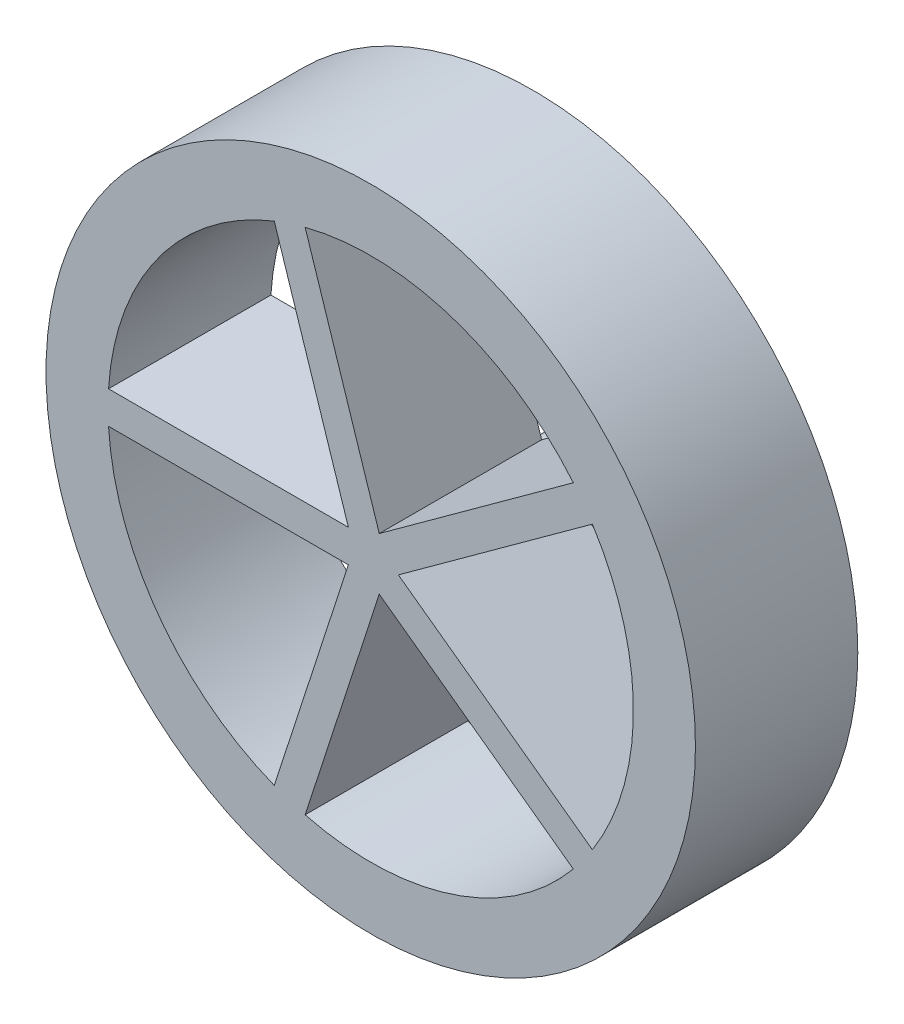
ISO-10303-21;
HEADER;
FILE_DESCRIPTION(('STEP AP214'),'2;1');
FILE_NAME('part.step','',(''),(''),'','','');
FILE_SCHEMA(('AUTOMOTIVE_DESIGN { 1 0 10303 214 1 1 1 1 }'));
ENDSEC;
DATA;
#1=APPLICATION_CONTEXT('core data for automotive mechanical design processes');
#2=APPLICATION_PROTOCOL_DEFINITION('international standard','automotive_design',2000,#1);
#3=PRODUCT_CONTEXT('',#1,'mechanical');
#4=PRODUCT('Part','Part','',(#3));
#5=PRODUCT_RELATED_PRODUCT_CATEGORY('part','',(#4));
#6=PRODUCT_DEFINITION_FORMATION('','',#4);
#7=PRODUCT_DEFINITION_CONTEXT('part definition',#1,'design');
#8=PRODUCT_DEFINITION('design','',#6,#7);
#9=PRODUCT_DEFINITION_SHAPE('','',#8);
#10=(LENGTH_UNIT() NAMED_UNIT(*) SI_UNIT(.MILLI.,.METRE.));
#11=(NAMED_UNIT(*) PLANE_ANGLE_UNIT() SI_UNIT($,.RADIAN.));
#12=(NAMED_UNIT(*) SI_UNIT($,.STERADIAN.) SOLID_ANGLE_UNIT());
#13=UNCERTAINTY_MEASURE_WITH_UNIT(LENGTH_MEASURE(1.E-05),#10,'distance_accuracy_value','');
#14=(GEOMETRIC_REPRESENTATION_CONTEXT(3) GLOBAL_UNCERTAINTY_ASSIGNED_CONTEXT((#13)) GLOBAL_UNIT_ASSIGNED_CONTEXT((#10,
#11,#12)) REPRESENTATION_CONTEXT('',''));
#15=CARTESIAN_POINT('',(0.,0.,0.));
#16=DIRECTION('',(0.,0.,1.));
#17=DIRECTION('',(1.,0.,0.));
#18=AXIS2_PLACEMENT_3D('',#15,#16,#17);
#19=CARTESIAN_POINT('',(0.,0.,-40.));
#20=DIRECTION('',(0.,0.,-1.));
#21=DIRECTION('',(-1.,0.,0.));
#22=AXIS2_PLACEMENT_3D('',#19,#20,#21);
#23=PLANE('',#22);
#24=CARTESIAN_POINT('',(0.,0.,-40.));
#25=DIRECTION('',(0.,0.,1.));
#26=DIRECTION('',(1.,0.,0.));
#27=AXIS2_PLACEMENT_3D('',#24,#25,#26);
#28=CIRCLE('',#27,5.);
#29=CARTESIAN_POINT('',(5.,0.,-40.));
#30=VERTEX_POINT('',#29);
#31=EDGE_CURVE('E20',#30,#30,#28,.T.);
#32=ORIENTED_EDGE('',*,*,#31,.F.);
#33=EDGE_LOOP('',(#32));
#34=FACE_BOUND('',#33,.T.);
#35=ADVANCED_FACE('F17',(#34),#23,.T.);
#36=CARTESIAN_POINT('',(0.,0.,-40.));
#37=DIRECTION('',(0.,0.,1.));
#38=DIRECTION('',(1.,0.,0.));
#39=AXIS2_PLACEMENT_3D('',#36,#37,#38);
#40=CYLINDRICAL_SURFACE('',#39,5.);
#41=CARTESIAN_POINT('',(0.,0.,-25.));
#42=DIRECTION('',(0.,0.,1.));
#43=DIRECTION('',(1.,0.,0.));
#44=AXIS2_PLACEMENT_3D('',#41,#42,#43);
#45=CIRCLE('',#44,5.);
#46=CARTESIAN_POINT('',(5.,0.,-25.));
#47=VERTEX_POINT('',#46);
#48=EDGE_CURVE('E148',#47,#47,#45,.T.);
#49=ORIENTED_EDGE('',*,*,#48,.F.);
#50=EDGE_LOOP('',(#49));
#51=FACE_BOUND('',#50,.T.);
#52=ORIENTED_EDGE('',*,*,#31,.T.);
#53=EDGE_LOOP('',(#52));
#54=FACE_BOUND('',#53,.T.);
#55=ADVANCED_FACE('F353',(#51,#54),#40,.T.);
#56=CARTESIAN_POINT('',(3.33066907387547E-13,0.,-25.));
#57=DIRECTION('',(0.,0.,1.));
#58=DIRECTION('',(1.,0.,0.));
#59=AXIS2_PLACEMENT_3D('',#56,#57,#58);
#60=CYLINDRICAL_SURFACE('',#59,80.9016994374944);
#61=CARTESIAN_POINT('',(3.33066907387547E-13,0.,-25.));
#62=DIRECTION('',(0.,0.,1.));
#63=DIRECTION('',(1.,0.,0.));
#64=AXIS2_PLACEMENT_3D('',#61,#62,#63);
#65=CIRCLE('',#64,80.9016994374944);
#66=CARTESIAN_POINT('',(68.2646563873199,-43.4168361375617,-25.));
#67=VERTEX_POINT('',#66);
#68=CARTESIAN_POINT('',(68.2646563873198,43.4168361375617,-25.));
#69=VERTEX_POINT('',#68);
#70=EDGE_CURVE('E163',#67,#69,#65,.T.);
#71=ORIENTED_EDGE('',*,*,#70,.F.);
#72=DIRECTION('',(0.,0.,1.));
#73=VECTOR('',#72,1.);
#74=CARTESIAN_POINT('',(68.2646563873199,-43.4168361375618,-25.));
#75=LINE('',#74,#73);
#76=CARTESIAN_POINT('',(68.2646563873199,-43.4168361375617,25.));
#77=VERTEX_POINT('',#76);
#78=EDGE_CURVE('E194',#77,#67,#75,.F.);
#79=ORIENTED_EDGE('',*,*,#78,.F.);
#80=CARTESIAN_POINT('',(3.33066907387547E-13,0.,25.));
#81=DIRECTION('',(0.,0.,1.));
#82=DIRECTION('',(1.,0.,0.));
#83=AXIS2_PLACEMENT_3D('',#80,#81,#82);
#84=CIRCLE('',#83,80.9016994374944);
#85=CARTESIAN_POINT('',(68.2646563873198,43.4168361375617,25.));
#86=VERTEX_POINT('',#85);
#87=EDGE_CURVE('E171',#77,#86,#84,.T.);
#88=ORIENTED_EDGE('',*,*,#87,.T.);
#89=DIRECTION('',(0.,0.,1.));
#90=VECTOR('',#89,1.);
#91=CARTESIAN_POINT('',(68.2646563873199,43.4168361375618,-25.));
#92=LINE('',#91,#90);
#93=EDGE_CURVE('E191',#69,#86,#92,.T.);
#94=ORIENTED_EDGE('',*,*,#93,.F.);
#95=EDGE_LOOP('',(#71,#79,#88,#94));
#96=FACE_BOUND('',#95,.T.);
#97=ADVANCED_FACE('F351',(#96),#60,.F.);
#98=CARTESIAN_POINT('',(49.0430471916489,29.4515196002079,-25.));
#99=DIRECTION('',(0.587785252292474,-0.809016994374947,0.));
#100=DIRECTION('',(0.809016994374947,0.587785252292474,0.));
#101=AXIS2_PLACEMENT_3D('',#98,#99,#100);
#102=PLANE('',#101);
#103=DIRECTION('',(-0.809016994374948,-0.587785252292473,0.));
#104=VECTOR('',#103,1.);
#105=CARTESIAN_POINT('',(68.2646563873199,43.4168361375617,-25.));
#106=LINE('',#105,#104);
#107=CARTESIAN_POINT('',(8.50650808352037,0.,-25.));
#108=VERTEX_POINT('',#107);
#109=EDGE_CURVE('E161',#69,#108,#106,.T.);
#110=ORIENTED_EDGE('',*,*,#109,.F.);
#111=ORIENTED_EDGE('',*,*,#93,.T.);
#112=DIRECTION('',(-0.809016994374947,-0.587785252292473,0.));
#113=VECTOR('',#112,1.);
#114=CARTESIAN_POINT('',(68.2646563873199,43.4168361375618,25.));
#115=LINE('',#114,#113);
#116=CARTESIAN_POINT('',(8.50650808352037,0.,25.));
#117=VERTEX_POINT('',#116);
#118=EDGE_CURVE('E174',#86,#117,#115,.T.);
#119=ORIENTED_EDGE('',*,*,#118,.T.);
#120=DIRECTION('',(0.,0.,1.));
#121=VECTOR('',#120,1.);
#122=CARTESIAN_POINT('',(8.50650808352037,0.,-25.));
#123=LINE('',#122,#121);
#124=EDGE_CURVE('E197',#108,#117,#123,.T.);
#125=ORIENTED_EDGE('',*,*,#124,.F.);
#126=EDGE_LOOP('',(#110,#111,#119,#125));
#127=FACE_BOUND('',#126,.T.);
#128=ADVANCED_FACE('F347',(#127),#102,.T.);
#129=CARTESIAN_POINT('',(12.1988394185127,-2.68263574235874,-25.));
#130=DIRECTION('',(0.587785252292473,0.809016994374948,0.));
#131=DIRECTION('',(-0.809016994374948,0.587785252292473,0.));
#132=AXIS2_PLACEMENT_3D('',#129,#130,#131);
#133=PLANE('',#132);
#134=DIRECTION('',(0.809016994374948,-0.587785252292472,0.));
#135=VECTOR('',#134,1.);
#136=CARTESIAN_POINT('',(8.50650808352037,0.,-25.));
#137=LINE('',#136,#135);
#138=EDGE_CURVE('E167',#108,#67,#137,.T.);
#139=ORIENTED_EDGE('',*,*,#138,.F.);
#140=ORIENTED_EDGE('',*,*,#124,.T.);
#141=DIRECTION('',(0.809016994374948,-0.587785252292472,0.));
#142=VECTOR('',#141,1.);
#143=CARTESIAN_POINT('',(8.50650808352037,0.,25.));
#144=LINE('',#143,#142);
#145=EDGE_CURVE('E178',#117,#77,#144,.T.);
#146=ORIENTED_EDGE('',*,*,#145,.T.);
#147=ORIENTED_EDGE('',*,*,#78,.T.);
#148=EDGE_LOOP('',(#139,#140,#146,#147));
#149=FACE_BOUND('',#148,.T.);
#150=ADVANCED_FACE('F349',(#149),#133,.T.);
#151=CARTESIAN_POINT('',(-1.52655665885959E-13,0.,-25.));
#152=DIRECTION('',(0.,0.,1.));
#153=DIRECTION('',(1.,0.,0.));
#154=AXIS2_PLACEMENT_3D('',#151,#152,#153);
#155=CYLINDRICAL_SURFACE('',#154,80.9016994374946);
#156=DIRECTION('',(0.,0.,1.));
#157=VECTOR('',#156,1.);
#158=CARTESIAN_POINT('',(-29.7074911496504,-75.2499165545596,-25.));
#159=LINE('',#158,#157);
#160=CARTESIAN_POINT('',(-29.7074911496504,-75.2499165545595,-25.));
#161=VERTEX_POINT('',#160);
#162=CARTESIAN_POINT('',(-29.7074911496503,-75.2499165545595,25.));
#163=VERTEX_POINT('',#162);
#164=EDGE_CURVE('E200',#161,#163,#159,.T.);
#165=ORIENTED_EDGE('',*,*,#164,.F.);
#166=CARTESIAN_POINT('',(-1.52655665885959E-13,0.,-25.));
#167=DIRECTION('',(0.,0.,1.));
#168=DIRECTION('',(1.,0.,0.));
#169=AXIS2_PLACEMENT_3D('',#166,#167,#168);
#170=CIRCLE('',#169,80.9016994374946);
#171=CARTESIAN_POINT('',(-80.7470431153658,-5.,-25.));
#172=VERTEX_POINT('',#171);
#173=EDGE_CURVE('E153',#172,#161,#170,.T.);
#174=ORIENTED_EDGE('',*,*,#173,.F.);
#175=DIRECTION('',(0.,0.,-1.));
#176=VECTOR('',#175,1.);
#177=CARTESIAN_POINT('',(-80.7470431153658,-5.,-25.));
#178=LINE('',#177,#176);
#179=CARTESIAN_POINT('',(-80.7470431153658,-5.,25.));
#180=VERTEX_POINT('',#179);
#181=EDGE_CURVE('E205',#180,#172,#178,.T.);
#182=ORIENTED_EDGE('',*,*,#181,.F.);
#183=CARTESIAN_POINT('',(-1.52655665885959E-13,0.,25.));
#184=DIRECTION('',(0.,0.,1.));
#185=DIRECTION('',(1.,0.,0.));
#186=AXIS2_PLACEMENT_3D('',#183,#184,#185);
#187=CIRCLE('',#186,80.9016994374946);
#188=EDGE_CURVE('E175',#180,#163,#187,.T.);
#189=ORIENTED_EDGE('',*,*,#188,.T.);
#190=EDGE_LOOP('',(#165,#174,#182,#189));
#191=FACE_BOUND('',#190,.T.);
#192=ADVANCED_FACE('F333',(#191),#155,.F.);
#193=CARTESIAN_POINT('',(-24.9568117249368,-60.6288286987213,-25.));
#194=DIRECTION('',(-0.951056516295154,0.309016994374947,0.));
#195=DIRECTION('',(-0.309016994374947,-0.951056516295154,0.));
#196=AXIS2_PLACEMENT_3D('',#193,#194,#195);
#197=PLANE('',#196);
#198=DIRECTION('',(0.309016994374947,0.951056516295154,0.));
#199=VECTOR('',#198,1.);
#200=CARTESIAN_POINT('',(-29.7074911496504,-75.2499165545596,-25.));
#201=LINE('',#200,#199);
#202=CARTESIAN_POINT('',(-6.88190960235593,-5.,-25.));
#203=VERTEX_POINT('',#202);
#204=EDGE_CURVE('E237',#161,#203,#201,.T.);
#205=ORIENTED_EDGE('',*,*,#204,.F.);
#206=ORIENTED_EDGE('',*,*,#164,.T.);
#207=DIRECTION('',(0.309016994374947,0.951056516295154,0.));
#208=VECTOR('',#207,1.);
#209=CARTESIAN_POINT('',(-29.7074911496504,-75.2499165545596,25.));
#210=LINE('',#209,#208);
#211=CARTESIAN_POINT('',(-6.88190960235589,-5.,25.));
#212=VERTEX_POINT('',#211);
#213=EDGE_CURVE('E177',#163,#212,#210,.T.);
#214=ORIENTED_EDGE('',*,*,#213,.T.);
#215=DIRECTION('',(0.,0.,-1.));
#216=VECTOR('',#215,1.);
#217=CARTESIAN_POINT('',(-6.88190960235593,-5.,-25.));
#218=LINE('',#217,#216);
#219=EDGE_CURVE('E208',#203,#212,#218,.F.);
#220=ORIENTED_EDGE('',*,*,#219,.F.);
#221=EDGE_LOOP('',(#205,#206,#214,#220));
#222=FACE_BOUND('',#221,.T.);
#223=ADVANCED_FACE('F336',(#222),#197,.T.);
#224=CARTESIAN_POINT('',(-16.5988505673766,-5.,-25.));
#225=DIRECTION('',(0.,-1.,0.));
#226=DIRECTION('',(0.,0.,-1.));
#227=AXIS2_PLACEMENT_3D('',#224,#225,#226);
#228=PLANE('',#227);
#229=DIRECTION('',(-1.,0.,0.));
#230=VECTOR('',#229,1.);
#231=CARTESIAN_POINT('',(0.,-5.,-25.));
#232=LINE('',#231,#230);
#233=EDGE_CURVE('E157',#203,#172,#232,.T.);
#234=ORIENTED_EDGE('',*,*,#233,.F.);
#235=ORIENTED_EDGE('',*,*,#219,.T.);
#236=DIRECTION('',(-1.,0.,0.));
#237=VECTOR('',#236,1.);
#238=CARTESIAN_POINT('',(0.,-5.,25.));
#239=LINE('',#238,#237);
#240=EDGE_CURVE('E280',#212,#180,#239,.T.);
#241=ORIENTED_EDGE('',*,*,#240,.T.);
#242=ORIENTED_EDGE('',*,*,#181,.T.);
#243=EDGE_LOOP('',(#234,#235,#241,#242));
#244=FACE_BOUND('',#243,.T.);
#245=ADVANCED_FACE('F329',(#244),#228,.T.);
#246=CARTESIAN_POINT('',(-4.03345578833799,-28.594040365191,-25.));
#247=DIRECTION('',(0.951056516295154,-0.309016994374947,0.));
#248=DIRECTION('',(0.309016994374947,0.951056516295154,0.));
#249=AXIS2_PLACEMENT_3D('',#246,#247,#248);
#250=PLANE('',#249);
#251=DIRECTION('',(-0.309016994374947,-0.951056516295154,0.));
#252=VECTOR('',#251,1.);
#253=CARTESIAN_POINT('',(2.62865556059565,-8.09016994374948,-25.));
#254=LINE('',#253,#252);
#255=CARTESIAN_POINT('',(2.62865556059565,-8.09016994374949,-25.));
#256=VERTEX_POINT('',#255);
#257=CARTESIAN_POINT('',(-20.1969259866989,-78.340086498309,-25.));
#258=VERTEX_POINT('',#257);
#259=EDGE_CURVE('E144',#256,#258,#254,.T.);
#260=ORIENTED_EDGE('',*,*,#259,.F.);
#261=DIRECTION('',(0.,0.,1.));
#262=VECTOR('',#261,1.);
#263=CARTESIAN_POINT('',(2.62865556059565,-8.09016994374948,-25.));
#264=LINE('',#263,#262);
#265=CARTESIAN_POINT('',(2.62865556059564,-8.09016994374948,25.));
#266=VERTEX_POINT('',#265);
#267=EDGE_CURVE('E138',#266,#256,#264,.F.);
#268=ORIENTED_EDGE('',*,*,#267,.F.);
#269=DIRECTION('',(-0.309016994374947,-0.951056516295154,0.));
#270=VECTOR('',#269,1.);
#271=CARTESIAN_POINT('',(2.62865556059565,-8.09016994374948,25.));
#272=LINE('',#271,#270);
#273=CARTESIAN_POINT('',(-20.1969259866989,-78.340086498309,25.));
#274=VERTEX_POINT('',#273);
#275=EDGE_CURVE('E181',#266,#274,#272,.T.);
#276=ORIENTED_EDGE('',*,*,#275,.T.);
#277=DIRECTION('',(0.,0.,1.));
#278=VECTOR('',#277,1.);
#279=CARTESIAN_POINT('',(-20.1969259866989,-78.340086498309,-25.));
#280=LINE('',#279,#278);
#281=EDGE_CURVE('E121',#274,#258,#280,.F.);
#282=ORIENTED_EDGE('',*,*,#281,.T.);
#283=EDGE_LOOP('',(#260,#268,#276,#282));
#284=FACE_BOUND('',#283,.T.);
#285=ADVANCED_FACE('F391',(#284),#250,.T.);
#286=CARTESIAN_POINT('',(0.,0.,-25.));
#287=DIRECTION('',(0.,0.,1.));
#288=DIRECTION('',(1.,0.,0.));
#289=AXIS2_PLACEMENT_3D('',#286,#287,#288);
#290=CYLINDRICAL_SURFACE('',#289,80.9016994374948);
#291=DIRECTION('',(0.,0.,1.));
#292=VECTOR('',#291,1.);
#293=CARTESIAN_POINT('',(62.3868038643952,-51.5070060813112,-25.));
#294=LINE('',#293,#292);
#295=CARTESIAN_POINT('',(62.3868038643952,-51.5070060813112,-25.));
#296=VERTEX_POINT('',#295);
#297=CARTESIAN_POINT('',(62.3868038643952,-51.5070060813112,25.));
#298=VERTEX_POINT('',#297);
#299=EDGE_CURVE('E126',#296,#298,#294,.T.);
#300=ORIENTED_EDGE('',*,*,#299,.F.);
#301=CARTESIAN_POINT('',(0.,0.,-25.));
#302=DIRECTION('',(0.,0.,1.));
#303=DIRECTION('',(1.,0.,0.));
#304=AXIS2_PLACEMENT_3D('',#301,#302,#303);
#305=CIRCLE('',#304,80.9016994374948);
#306=EDGE_CURVE('E130',#258,#296,#305,.T.);
#307=ORIENTED_EDGE('',*,*,#306,.F.);
#308=ORIENTED_EDGE('',*,*,#281,.F.);
#309=CARTESIAN_POINT('',(0.,0.,25.));
#310=DIRECTION('',(0.,0.,1.));
#311=DIRECTION('',(1.,0.,0.));
#312=AXIS2_PLACEMENT_3D('',#309,#310,#311);
#313=CIRCLE('',#312,80.9016994374948);
#314=EDGE_CURVE('E133',#274,#298,#313,.T.);
#315=ORIENTED_EDGE('',*,*,#314,.T.);
#316=EDGE_LOOP('',(#300,#307,#308,#315));
#317=FACE_BOUND('',#316,.T.);
#318=ADVANCED_FACE('F128',(#317),#290,.F.);
#319=CARTESIAN_POINT('',(36.2000610474877,-32.4812237548891,-25.));
#320=DIRECTION('',(-0.587785252292473,-0.809016994374948,0.));
#321=DIRECTION('',(0.809016994374948,-0.587785252292473,0.));
#322=AXIS2_PLACEMENT_3D('',#319,#320,#321);
#323=PLANE('',#322);
#324=DIRECTION('',(-0.809016994374948,0.587785252292472,0.));
#325=VECTOR('',#324,1.);
#326=CARTESIAN_POINT('',(62.3868038643952,-51.5070060813112,-25.));
#327=LINE('',#326,#325);
#328=EDGE_CURVE('E141',#296,#256,#327,.T.);
#329=ORIENTED_EDGE('',*,*,#328,.F.);
#330=ORIENTED_EDGE('',*,*,#299,.T.);
#331=DIRECTION('',(-0.809016994374948,0.587785252292472,0.));
#332=VECTOR('',#331,1.);
#333=CARTESIAN_POINT('',(62.3868038643952,-51.5070060813112,25.));
#334=LINE('',#333,#332);
#335=EDGE_CURVE('E180',#298,#266,#334,.T.);
#336=ORIENTED_EDGE('',*,*,#335,.T.);
#337=ORIENTED_EDGE('',*,*,#267,.T.);
#338=EDGE_LOOP('',(#329,#330,#336,#337));
#339=FACE_BOUND('',#338,.T.);
#340=ADVANCED_FACE('F142',(#339),#323,.T.);
#341=CARTESIAN_POINT('',(-1.28369537222284E-13,1.83880688453541E-13,-25.));
#342=DIRECTION('',(0.,0.,1.));
#343=DIRECTION('',(1.,0.,0.));
#344=AXIS2_PLACEMENT_3D('',#341,#342,#343);
#345=CYLINDRICAL_SURFACE('',#344,80.9016994374945);
#346=DIRECTION('',(0.,0.,1.));
#347=VECTOR('',#346,1.);
#348=CARTESIAN_POINT('',(-80.7470431153658,5.,-25.));
#349=LINE('',#348,#347);
#350=CARTESIAN_POINT('',(-80.7470431153657,5.,-25.));
#351=VERTEX_POINT('',#350);
#352=CARTESIAN_POINT('',(-80.7470431153657,5.,25.));
#353=VERTEX_POINT('',#352);
#354=EDGE_CURVE('E137',#351,#353,#349,.T.);
#355=ORIENTED_EDGE('',*,*,#354,.F.);
#356=CARTESIAN_POINT('',(-1.28369537222284E-13,1.83880688453541E-13,-25.));
#357=DIRECTION('',(0.,0.,1.));
#358=DIRECTION('',(1.,0.,0.));
#359=AXIS2_PLACEMENT_3D('',#356,#357,#358);
#360=CIRCLE('',#359,80.9016994374945);
#361=CARTESIAN_POINT('',(-29.7074911496503,75.2499165545596,-25.));
#362=VERTEX_POINT('',#361);
#363=EDGE_CURVE('E158',#362,#351,#360,.T.);
#364=ORIENTED_EDGE('',*,*,#363,.F.);
#365=DIRECTION('',(0.,0.,1.));
#366=VECTOR('',#365,1.);
#367=CARTESIAN_POINT('',(-29.7074911496502,75.2499165545596,-25.));
#368=LINE('',#367,#366);
#369=CARTESIAN_POINT('',(-29.7074911496503,75.2499165545596,25.));
#370=VERTEX_POINT('',#369);
#371=EDGE_CURVE('E218',#370,#362,#368,.F.);
#372=ORIENTED_EDGE('',*,*,#371,.F.);
#373=CARTESIAN_POINT('',(-1.28369537222284E-13,1.83880688453541E-13,25.));
#374=DIRECTION('',(0.,0.,1.));
#375=DIRECTION('',(1.,0.,0.));
#376=AXIS2_PLACEMENT_3D('',#373,#374,#375);
#377=CIRCLE('',#376,80.9016994374945);
#378=EDGE_CURVE('E182',#370,#353,#377,.T.);
#379=ORIENTED_EDGE('',*,*,#378,.T.);
#380=EDGE_LOOP('',(#355,#364,#372,#379));
#381=FACE_BOUND('',#380,.T.);
#382=ADVANCED_FACE('F382',(#381),#345,.F.);
#383=CARTESIAN_POINT('',(-53.5314173238815,5.,-25.));
#384=DIRECTION('',(0.,1.,0.));
#385=DIRECTION('',(0.,0.,1.));
#386=AXIS2_PLACEMENT_3D('',#383,#384,#385);
#387=PLANE('',#386);
#388=DIRECTION('',(-1.,0.,0.));
#389=VECTOR('',#388,1.);
#390=CARTESIAN_POINT('',(0.,5.,-25.));
#391=LINE('',#390,#389);
#392=CARTESIAN_POINT('',(-6.88190960235587,5.,-25.));
#393=VERTEX_POINT('',#392);
#394=EDGE_CURVE('E156',#351,#393,#391,.F.);
#395=ORIENTED_EDGE('',*,*,#394,.F.);
#396=ORIENTED_EDGE('',*,*,#354,.T.);
#397=DIRECTION('',(-1.,0.,0.));
#398=VECTOR('',#397,1.);
#399=CARTESIAN_POINT('',(0.,5.,25.));
#400=LINE('',#399,#398);
#401=CARTESIAN_POINT('',(-6.88190960235587,5.,25.));
#402=VERTEX_POINT('',#401);
#403=EDGE_CURVE('E184',#353,#402,#400,.F.);
#404=ORIENTED_EDGE('',*,*,#403,.T.);
#405=DIRECTION('',(0.,0.,1.));
#406=VECTOR('',#405,1.);
#407=CARTESIAN_POINT('',(-6.88190960235586,5.,-25.));
#408=LINE('',#407,#406);
#409=EDGE_CURVE('E221',#393,#402,#408,.T.);
#410=ORIENTED_EDGE('',*,*,#409,.F.);
#411=EDGE_LOOP('',(#395,#396,#404,#410));
#412=FACE_BOUND('',#411,.T.);
#413=ADVANCED_FACE('F378',(#412),#387,.T.);
#414=CARTESIAN_POINT('',(-8.1962373826537,9.04508497187478,-25.));
#415=DIRECTION('',(-0.951056516295154,-0.309016994374946,0.));
#416=DIRECTION('',(0.309016994374946,-0.951056516295154,0.));
#417=AXIS2_PLACEMENT_3D('',#414,#415,#416);
#418=PLANE('',#417);
#419=DIRECTION('',(-0.309016994374947,0.951056516295154,0.));
#420=VECTOR('',#419,1.);
#421=CARTESIAN_POINT('',(-6.88190960235587,5.,-25.));
#422=LINE('',#421,#420);
#423=EDGE_CURVE('E162',#393,#362,#422,.T.);
#424=ORIENTED_EDGE('',*,*,#423,.F.);
#425=ORIENTED_EDGE('',*,*,#409,.T.);
#426=DIRECTION('',(-0.309016994374947,0.951056516295154,0.));
#427=VECTOR('',#426,1.);
#428=CARTESIAN_POINT('',(-6.88190960235587,5.,25.));
#429=LINE('',#428,#427);
#430=EDGE_CURVE('E187',#402,#370,#429,.T.);
#431=ORIENTED_EDGE('',*,*,#430,.T.);
#432=ORIENTED_EDGE('',*,*,#371,.T.);
#433=EDGE_LOOP('',(#424,#425,#431,#432));
#434=FACE_BOUND('',#433,.T.);
#435=ADVANCED_FACE('F375',(#434),#418,.T.);
#436=CARTESIAN_POINT('',(0.,0.,-25.));
#437=DIRECTION('',(0.,0.,1.));
#438=DIRECTION('',(1.,0.,0.));
#439=AXIS2_PLACEMENT_3D('',#436,#437,#438);
#440=CYLINDRICAL_SURFACE('',#439,80.9016994374947);
#441=DIRECTION('',(0.,0.,1.));
#442=VECTOR('',#441,1.);
#443=CARTESIAN_POINT('',(-20.1969259866989,78.3400864983091,-25.));
#444=LINE('',#443,#442);
#445=CARTESIAN_POINT('',(-20.1969259866989,78.3400864983091,-25.));
#446=VERTEX_POINT('',#445);
#447=CARTESIAN_POINT('',(-20.1969259866989,78.3400864983091,25.));
#448=VERTEX_POINT('',#447);
#449=EDGE_CURVE('E224',#446,#448,#444,.T.);
#450=ORIENTED_EDGE('',*,*,#449,.F.);
#451=CARTESIAN_POINT('',(0.,0.,-25.));
#452=DIRECTION('',(0.,0.,1.));
#453=DIRECTION('',(1.,0.,0.));
#454=AXIS2_PLACEMENT_3D('',#451,#452,#453);
#455=CIRCLE('',#454,80.9016994374947);
#456=CARTESIAN_POINT('',(62.3868038643951,51.5070060813112,-25.));
#457=VERTEX_POINT('',#456);
#458=EDGE_CURVE('E168',#457,#446,#455,.T.);
#459=ORIENTED_EDGE('',*,*,#458,.F.);
#460=DIRECTION('',(0.,0.,1.));
#461=VECTOR('',#460,1.);
#462=CARTESIAN_POINT('',(62.3868038643951,51.5070060813112,-25.));
#463=LINE('',#462,#461);
#464=CARTESIAN_POINT('',(62.3868038643951,51.5070060813112,25.));
#465=VERTEX_POINT('',#464);
#466=EDGE_CURVE('E227',#465,#457,#463,.F.);
#467=ORIENTED_EDGE('',*,*,#466,.F.);
#468=CARTESIAN_POINT('',(0.,0.,25.));
#469=DIRECTION('',(0.,0.,1.));
#470=DIRECTION('',(1.,0.,0.));
#471=AXIS2_PLACEMENT_3D('',#468,#469,#470);
#472=CIRCLE('',#471,80.9016994374947);
#473=EDGE_CURVE('E185',#465,#448,#472,.T.);
#474=ORIENTED_EDGE('',*,*,#473,.T.);
#475=EDGE_LOOP('',(#450,#459,#467,#474));
#476=FACE_BOUND('',#475,.T.);
#477=ADVANCED_FACE('F314',(#476),#440,.F.);
#478=CARTESIAN_POINT('',(-10.0984629933494,47.260213192904,-25.));
#479=DIRECTION('',(0.951056516295153,0.309016994374948,0.));
#480=DIRECTION('',(-0.309016994374948,0.951056516295153,0.));
#481=AXIS2_PLACEMENT_3D('',#478,#479,#480);
#482=PLANE('',#481);
#483=DIRECTION('',(0.309016994374948,-0.951056516295154,0.));
#484=VECTOR('',#483,1.);
#485=CARTESIAN_POINT('',(-20.1969259866988,78.3400864983091,-25.));
#486=LINE('',#485,#484);
#487=CARTESIAN_POINT('',(2.6286555605957,8.09016994374947,-25.));
#488=VERTEX_POINT('',#487);
#489=EDGE_CURVE('E166',#446,#488,#486,.T.);
#490=ORIENTED_EDGE('',*,*,#489,.F.);
#491=ORIENTED_EDGE('',*,*,#449,.T.);
#492=DIRECTION('',(0.309016994374948,-0.951056516295154,0.));
#493=VECTOR('',#492,1.);
#494=CARTESIAN_POINT('',(-20.1969259866988,78.3400864983091,25.));
#495=LINE('',#494,#493);
#496=CARTESIAN_POINT('',(2.6286555605957,8.09016994374948,25.));
#497=VERTEX_POINT('',#496);
#498=EDGE_CURVE('E35',#448,#497,#495,.T.);
#499=ORIENTED_EDGE('',*,*,#498,.T.);
#500=DIRECTION('',(0.,0.,1.));
#501=VECTOR('',#500,1.);
#502=CARTESIAN_POINT('',(2.6286555605957,8.09016994374948,-25.));
#503=LINE('',#502,#501);
#504=EDGE_CURVE('E151',#488,#497,#503,.T.);
#505=ORIENTED_EDGE('',*,*,#504,.F.);
#506=EDGE_LOOP('',(#490,#491,#499,#505));
#507=FACE_BOUND('',#506,.T.);
#508=ADVANCED_FACE('F316',(#507),#482,.T.);
#509=CARTESIAN_POINT('',(13.2861205168244,15.8332714751764,-25.));
#510=DIRECTION('',(-0.587785252292474,0.809016994374947,0.));
#511=DIRECTION('',(-0.809016994374947,-0.587785252292474,0.));
#512=AXIS2_PLACEMENT_3D('',#509,#510,#511);
#513=PLANE('',#512);
#514=DIRECTION('',(0.809016994374947,0.587785252292474,0.));
#515=VECTOR('',#514,1.);
#516=CARTESIAN_POINT('',(2.6286555605957,8.09016994374947,-25.));
#517=LINE('',#516,#515);
#518=EDGE_CURVE('E172',#488,#457,#517,.T.);
#519=ORIENTED_EDGE('',*,*,#518,.F.);
#520=ORIENTED_EDGE('',*,*,#504,.T.);
#521=DIRECTION('',(0.809016994374947,0.587785252292473,0.));
#522=VECTOR('',#521,1.);
#523=CARTESIAN_POINT('',(2.62865556059569,8.09016994374947,25.));
#524=LINE('',#523,#522);
#525=EDGE_CURVE('E189',#497,#465,#524,.T.);
#526=ORIENTED_EDGE('',*,*,#525,.T.);
#527=ORIENTED_EDGE('',*,*,#466,.T.);
#528=EDGE_LOOP('',(#519,#520,#526,#527));
#529=FACE_BOUND('',#528,.T.);
#530=ADVANCED_FACE('F308',(#529),#513,.T.);
#531=CARTESIAN_POINT('',(0.,0.,-25.));
#532=DIRECTION('',(0.,0.,-1.));
#533=DIRECTION('',(-1.,0.,0.));
#534=AXIS2_PLACEMENT_3D('',#531,#532,#533);
#535=PLANE('',#534);
#536=ORIENTED_EDGE('',*,*,#518,.T.);
#537=ORIENTED_EDGE('',*,*,#458,.T.);
#538=ORIENTED_EDGE('',*,*,#489,.T.);
#539=EDGE_LOOP('',(#536,#537,#538));
#540=FACE_BOUND('',#539,.T.);
#541=ORIENTED_EDGE('',*,*,#138,.T.);
#542=ORIENTED_EDGE('',*,*,#70,.T.);
#543=ORIENTED_EDGE('',*,*,#109,.T.);
#544=EDGE_LOOP('',(#541,#542,#543));
#545=FACE_BOUND('',#544,.T.);
#546=ORIENTED_EDGE('',*,*,#423,.T.);
#547=ORIENTED_EDGE('',*,*,#363,.T.);
#548=ORIENTED_EDGE('',*,*,#394,.T.);
#549=EDGE_LOOP('',(#546,#547,#548));
#550=FACE_BOUND('',#549,.T.);
#551=ORIENTED_EDGE('',*,*,#233,.T.);
#552=ORIENTED_EDGE('',*,*,#173,.T.);
#553=ORIENTED_EDGE('',*,*,#204,.T.);
#554=EDGE_LOOP('',(#551,#552,#553));
#555=FACE_BOUND('',#554,.T.);
#556=ORIENTED_EDGE('',*,*,#328,.T.);
#557=ORIENTED_EDGE('',*,*,#259,.T.);
#558=ORIENTED_EDGE('',*,*,#306,.T.);
#559=EDGE_LOOP('',(#556,#557,#558));
#560=FACE_BOUND('',#559,.T.);
#561=CARTESIAN_POINT('',(0.,0.,-25.));
#562=DIRECTION('',(0.,0.,1.));
#563=DIRECTION('',(1.,0.,0.));
#564=AXIS2_PLACEMENT_3D('',#561,#562,#563);
#565=CIRCLE('',#564,100.);
#566=CARTESIAN_POINT('',(100.,0.,-25.));
#567=VERTEX_POINT('',#566);
#568=EDGE_CURVE('E26',#567,#567,#565,.T.);
#569=ORIENTED_EDGE('',*,*,#568,.F.);
#570=EDGE_LOOP('',(#569));
#571=FACE_BOUND('',#570,.T.);
#572=ORIENTED_EDGE('',*,*,#48,.T.);
#573=EDGE_LOOP('',(#572));
#574=FACE_BOUND('',#573,.T.);
#575=ADVANCED_FACE('F146',(#540,#545,#550,#555,#560,#571,#574),#535,.T.);
#576=CARTESIAN_POINT('',(0.,0.,25.));
#577=DIRECTION('',(0.,0.,-1.));
#578=DIRECTION('',(-1.,0.,0.));
#579=AXIS2_PLACEMENT_3D('',#576,#577,#578);
#580=PLANE('',#579);
#581=ORIENTED_EDGE('',*,*,#498,.F.);
#582=ORIENTED_EDGE('',*,*,#473,.F.);
#583=ORIENTED_EDGE('',*,*,#525,.F.);
#584=EDGE_LOOP('',(#581,#582,#583));
#585=FACE_BOUND('',#584,.T.);
#586=ORIENTED_EDGE('',*,*,#403,.F.);
#587=ORIENTED_EDGE('',*,*,#378,.F.);
#588=ORIENTED_EDGE('',*,*,#430,.F.);
#589=EDGE_LOOP('',(#586,#587,#588));
#590=FACE_BOUND('',#589,.T.);
#591=ORIENTED_EDGE('',*,*,#314,.F.);
#592=ORIENTED_EDGE('',*,*,#275,.F.);
#593=ORIENTED_EDGE('',*,*,#335,.F.);
#594=EDGE_LOOP('',(#591,#592,#593));
#595=FACE_BOUND('',#594,.T.);
#596=CARTESIAN_POINT('',(0.,0.,25.));
#597=DIRECTION('',(0.,0.,1.));
#598=DIRECTION('',(1.,0.,0.));
#599=AXIS2_PLACEMENT_3D('',#596,#597,#598);
#600=CIRCLE('',#599,100.);
#601=CARTESIAN_POINT('',(100.,0.,25.));
#602=VERTEX_POINT('',#601);
#603=EDGE_CURVE('E10',#602,#602,#600,.F.);
#604=ORIENTED_EDGE('',*,*,#603,.F.);
#605=EDGE_LOOP('',(#604));
#606=FACE_BOUND('',#605,.T.);
#607=ORIENTED_EDGE('',*,*,#213,.F.);
#608=ORIENTED_EDGE('',*,*,#188,.F.);
#609=ORIENTED_EDGE('',*,*,#240,.F.);
#610=EDGE_LOOP('',(#607,#608,#609));
#611=FACE_BOUND('',#610,.T.);
#612=ORIENTED_EDGE('',*,*,#118,.F.);
#613=ORIENTED_EDGE('',*,*,#87,.F.);
#614=ORIENTED_EDGE('',*,*,#145,.F.);
#615=EDGE_LOOP('',(#612,#613,#614));
#616=FACE_BOUND('',#615,.T.);
#617=ADVANCED_FACE('F311',(#585,#590,#595,#606,#611,#616),#580,.F.);
#618=CARTESIAN_POINT('',(0.,0.,-25.));
#619=DIRECTION('',(0.,0.,1.));
#620=DIRECTION('',(1.,0.,0.));
#621=AXIS2_PLACEMENT_3D('',#618,#619,#620);
#622=CYLINDRICAL_SURFACE('',#621,100.);
#623=ORIENTED_EDGE('',*,*,#603,.T.);
#624=EDGE_LOOP('',(#623));
#625=FACE_BOUND('',#624,.T.);
#626=ORIENTED_EDGE('',*,*,#568,.T.);
#627=EDGE_LOOP('',(#626));
#628=FACE_BOUND('',#627,.T.);
#629=ADVANCED_FACE('F340',(#625,#628),#622,.T.);
#630=CLOSED_SHELL('',(#35,#55,#97,#128,#150,#192,#223,#245,#285,#318,#340,#382,#413,#435,#477,
#508,#530,#575,#617,#629));
#631=MANIFOLD_SOLID_BREP('B1',#630);
#632=ADVANCED_BREP_SHAPE_REPRESENTATION('',(#18,#631),#14);
#633=SHAPE_DEFINITION_REPRESENTATION(#9,#632);
ENDSEC;
END-ISO-10303-21;
